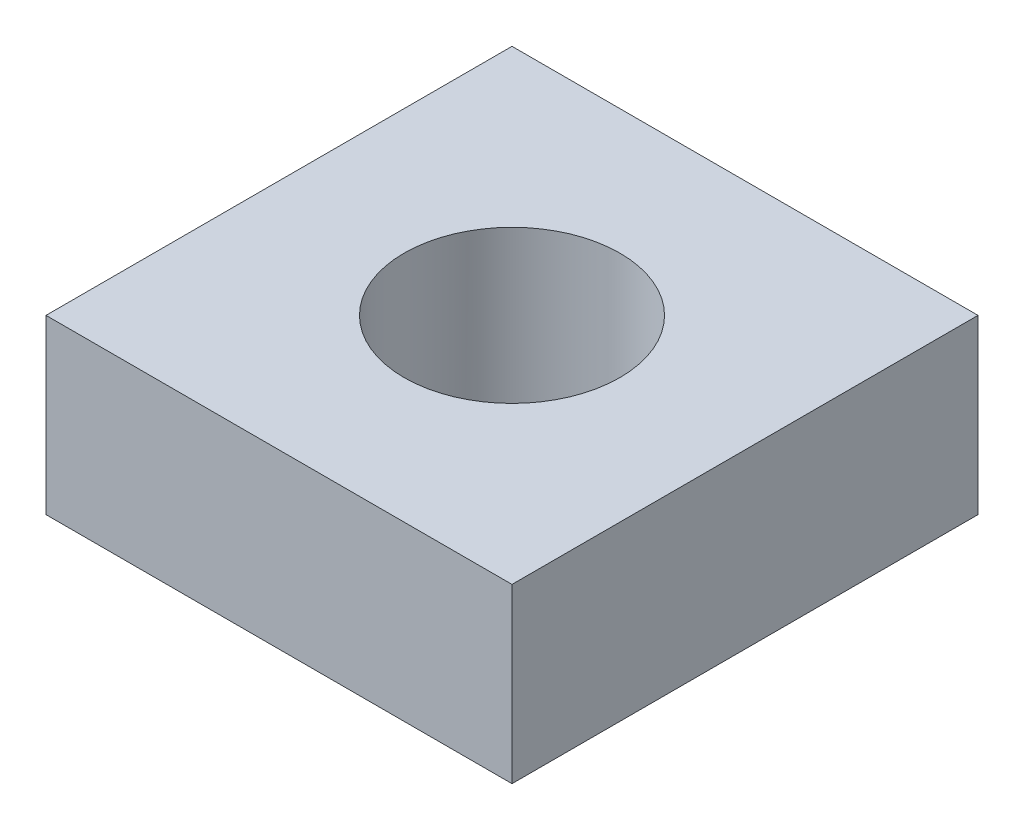
ISO-10303-21;
HEADER;
FILE_DESCRIPTION(('STEP AP214'),'2;1');
FILE_NAME('part.step','',(''),(''),'','','');
FILE_SCHEMA(('AUTOMOTIVE_DESIGN { 1 0 10303 214 1 1 1 1 }'));
ENDSEC;
DATA;
#1=APPLICATION_CONTEXT('core data for automotive mechanical design processes');
#2=APPLICATION_PROTOCOL_DEFINITION('international standard','automotive_design',2000,#1);
#3=PRODUCT_CONTEXT('',#1,'mechanical');
#4=PRODUCT('Part','Part','',(#3));
#5=PRODUCT_RELATED_PRODUCT_CATEGORY('part','',(#4));
#6=PRODUCT_DEFINITION_FORMATION('','',#4);
#7=PRODUCT_DEFINITION_CONTEXT('part definition',#1,'design');
#8=PRODUCT_DEFINITION('design','',#6,#7);
#9=PRODUCT_DEFINITION_SHAPE('','',#8);
#10=(LENGTH_UNIT() NAMED_UNIT(*) SI_UNIT(.MILLI.,.METRE.));
#11=(NAMED_UNIT(*) PLANE_ANGLE_UNIT() SI_UNIT($,.RADIAN.));
#12=(NAMED_UNIT(*) SI_UNIT($,.STERADIAN.) SOLID_ANGLE_UNIT());
#13=UNCERTAINTY_MEASURE_WITH_UNIT(LENGTH_MEASURE(1.E-05),#10,'distance_accuracy_value','');
#14=(GEOMETRIC_REPRESENTATION_CONTEXT(3) GLOBAL_UNCERTAINTY_ASSIGNED_CONTEXT((#13)) GLOBAL_UNIT_ASSIGNED_CONTEXT((#10,
#11,#12)) REPRESENTATION_CONTEXT('',''));
#15=CARTESIAN_POINT('',(0.,0.,0.));
#16=DIRECTION('',(0.,0.,1.));
#17=DIRECTION('',(1.,0.,0.));
#18=AXIS2_PLACEMENT_3D('',#15,#16,#17);
#19=CARTESIAN_POINT('',(2.7,2.,-2.7));
#20=DIRECTION('',(-1.,0.,0.));
#21=DIRECTION('',(0.,0.,1.));
#22=AXIS2_PLACEMENT_3D('',#19,#20,#21);
#23=PLANE('',#22);
#24=DIRECTION('',(0.,0.,-1.));
#25=VECTOR('',#24,1.);
#26=CARTESIAN_POINT('',(2.7,0.,-2.7));
#27=LINE('',#26,#25);
#28=CARTESIAN_POINT('',(2.7,0.,2.7));
#29=VERTEX_POINT('',#28);
#30=CARTESIAN_POINT('',(2.7,0.,-2.7));
#31=VERTEX_POINT('',#30);
#32=EDGE_CURVE('E102',#29,#31,#27,.T.);
#33=ORIENTED_EDGE('',*,*,#32,.T.);
#34=DIRECTION('',(0.,-1.,0.));
#35=VECTOR('',#34,1.);
#36=CARTESIAN_POINT('',(2.7,2.,-2.7));
#37=LINE('',#36,#35);
#38=CARTESIAN_POINT('',(2.7,2.,-2.7));
#39=VERTEX_POINT('',#38);
#40=EDGE_CURVE('E11',#39,#31,#37,.T.);
#41=ORIENTED_EDGE('',*,*,#40,.F.);
#42=DIRECTION('',(0.,0.,-1.));
#43=VECTOR('',#42,1.);
#44=CARTESIAN_POINT('',(2.7,2.,-2.7));
#45=LINE('',#44,#43);
#46=CARTESIAN_POINT('',(2.7,2.,2.7));
#47=VERTEX_POINT('',#46);
#48=EDGE_CURVE('E90',#47,#39,#45,.T.);
#49=ORIENTED_EDGE('',*,*,#48,.F.);
#50=DIRECTION('',(0.,-1.,0.));
#51=VECTOR('',#50,1.);
#52=CARTESIAN_POINT('',(2.7,2.,2.7));
#53=LINE('',#52,#51);
#54=EDGE_CURVE('E98',#47,#29,#53,.T.);
#55=ORIENTED_EDGE('',*,*,#54,.T.);
#56=EDGE_LOOP('',(#33,#41,#49,#55));
#57=FACE_BOUND('',#56,.T.);
#58=ADVANCED_FACE('F39',(#57),#23,.F.);
#59=CARTESIAN_POINT('',(-2.7,2.,-2.7));
#60=DIRECTION('',(0.,0.,1.));
#61=DIRECTION('',(1.,0.,0.));
#62=AXIS2_PLACEMENT_3D('',#59,#60,#61);
#63=PLANE('',#62);
#64=DIRECTION('',(-1.,0.,0.));
#65=VECTOR('',#64,1.);
#66=CARTESIAN_POINT('',(-2.7,0.,-2.7));
#67=LINE('',#66,#65);
#68=CARTESIAN_POINT('',(-2.7,0.,-2.7));
#69=VERTEX_POINT('',#68);
#70=EDGE_CURVE('E94',#31,#69,#67,.T.);
#71=ORIENTED_EDGE('',*,*,#70,.T.);
#72=DIRECTION('',(0.,-1.,0.));
#73=VECTOR('',#72,1.);
#74=CARTESIAN_POINT('',(-2.7,2.,-2.7));
#75=LINE('',#74,#73);
#76=CARTESIAN_POINT('',(-2.7,2.,-2.7));
#77=VERTEX_POINT('',#76);
#78=EDGE_CURVE('E47',#77,#69,#75,.T.);
#79=ORIENTED_EDGE('',*,*,#78,.F.);
#80=DIRECTION('',(-1.,0.,0.));
#81=VECTOR('',#80,1.);
#82=CARTESIAN_POINT('',(-2.7,2.,-2.7));
#83=LINE('',#82,#81);
#84=EDGE_CURVE('E85',#39,#77,#83,.T.);
#85=ORIENTED_EDGE('',*,*,#84,.F.);
#86=ORIENTED_EDGE('',*,*,#40,.T.);
#87=EDGE_LOOP('',(#71,#79,#85,#86));
#88=FACE_BOUND('',#87,.T.);
#89=ADVANCED_FACE('F93',(#88),#63,.F.);
#90=CARTESIAN_POINT('',(-2.7,2.,-2.7));
#91=DIRECTION('',(1.,0.,0.));
#92=DIRECTION('',(0.,0.,-1.));
#93=AXIS2_PLACEMENT_3D('',#90,#91,#92);
#94=PLANE('',#93);
#95=DIRECTION('',(0.,0.,1.));
#96=VECTOR('',#95,1.);
#97=CARTESIAN_POINT('',(-2.7,0.,-2.7));
#98=LINE('',#97,#96);
#99=CARTESIAN_POINT('',(-2.7,0.,2.7));
#100=VERTEX_POINT('',#99);
#101=EDGE_CURVE('E72',#69,#100,#98,.T.);
#102=ORIENTED_EDGE('',*,*,#101,.T.);
#103=DIRECTION('',(0.,-1.,0.));
#104=VECTOR('',#103,1.);
#105=CARTESIAN_POINT('',(-2.7,2.,2.7));
#106=LINE('',#105,#104);
#107=CARTESIAN_POINT('',(-2.7,2.,2.7));
#108=VERTEX_POINT('',#107);
#109=EDGE_CURVE('E95',#108,#100,#106,.T.);
#110=ORIENTED_EDGE('',*,*,#109,.F.);
#111=DIRECTION('',(0.,0.,1.));
#112=VECTOR('',#111,1.);
#113=CARTESIAN_POINT('',(-2.7,2.,-2.7));
#114=LINE('',#113,#112);
#115=EDGE_CURVE('E88',#77,#108,#114,.T.);
#116=ORIENTED_EDGE('',*,*,#115,.F.);
#117=ORIENTED_EDGE('',*,*,#78,.T.);
#118=EDGE_LOOP('',(#102,#110,#116,#117));
#119=FACE_BOUND('',#118,.T.);
#120=ADVANCED_FACE('F96',(#119),#94,.F.);
#121=CARTESIAN_POINT('',(-2.7,2.,2.7));
#122=DIRECTION('',(0.,0.,-1.));
#123=DIRECTION('',(-1.,0.,0.));
#124=AXIS2_PLACEMENT_3D('',#121,#122,#123);
#125=PLANE('',#124);
#126=DIRECTION('',(1.,0.,0.));
#127=VECTOR('',#126,1.);
#128=CARTESIAN_POINT('',(-2.7,0.,2.7));
#129=LINE('',#128,#127);
#130=EDGE_CURVE('E78',#100,#29,#129,.T.);
#131=ORIENTED_EDGE('',*,*,#130,.T.);
#132=ORIENTED_EDGE('',*,*,#54,.F.);
#133=DIRECTION('',(1.,0.,0.));
#134=VECTOR('',#133,1.);
#135=CARTESIAN_POINT('',(-2.7,2.,2.7));
#136=LINE('',#135,#134);
#137=EDGE_CURVE('E55',#108,#47,#136,.T.);
#138=ORIENTED_EDGE('',*,*,#137,.F.);
#139=ORIENTED_EDGE('',*,*,#109,.T.);
#140=EDGE_LOOP('',(#131,#132,#138,#139));
#141=FACE_BOUND('',#140,.T.);
#142=ADVANCED_FACE('F110',(#141),#125,.F.);
#143=CARTESIAN_POINT('',(0.,2.,0.));
#144=DIRECTION('',(0.,1.,0.));
#145=DIRECTION('',(0.,0.,1.));
#146=AXIS2_PLACEMENT_3D('',#143,#144,#145);
#147=PLANE('',#146);
#148=CARTESIAN_POINT('',(0.,2.,0.));
#149=DIRECTION('',(0.,1.,0.));
#150=DIRECTION('',(0.,0.,1.));
#151=AXIS2_PLACEMENT_3D('',#148,#149,#150);
#152=CIRCLE('',#151,1.24999999999999);
#153=CARTESIAN_POINT('',(0.,2.,1.24999999999999));
#154=VERTEX_POINT('',#153);
#155=EDGE_CURVE('E105',#154,#154,#152,.T.);
#156=ORIENTED_EDGE('',*,*,#155,.F.);
#157=EDGE_LOOP('',(#156));
#158=FACE_BOUND('',#157,.T.);
#159=ORIENTED_EDGE('',*,*,#48,.T.);
#160=ORIENTED_EDGE('',*,*,#84,.T.);
#161=ORIENTED_EDGE('',*,*,#115,.T.);
#162=ORIENTED_EDGE('',*,*,#137,.T.);
#163=EDGE_LOOP('',(#159,#160,#161,#162));
#164=FACE_BOUND('',#163,.T.);
#165=ADVANCED_FACE('F86',(#158,#164),#147,.T.);
#166=CARTESIAN_POINT('',(0.,0.,0.));
#167=DIRECTION('',(0.,1.,0.));
#168=DIRECTION('',(0.,0.,1.));
#169=AXIS2_PLACEMENT_3D('',#166,#167,#168);
#170=PLANE('',#169);
#171=CARTESIAN_POINT('',(0.,0.,0.));
#172=DIRECTION('',(0.,-1.,0.));
#173=DIRECTION('',(0.,0.,-1.));
#174=AXIS2_PLACEMENT_3D('',#171,#172,#173);
#175=CIRCLE('',#174,1.24999999999999);
#176=CARTESIAN_POINT('',(0.,0.,-1.24999999999999));
#177=VERTEX_POINT('',#176);
#178=EDGE_CURVE('E118',#177,#177,#175,.T.);
#179=ORIENTED_EDGE('',*,*,#178,.F.);
#180=EDGE_LOOP('',(#179));
#181=FACE_BOUND('',#180,.T.);
#182=ORIENTED_EDGE('',*,*,#32,.F.);
#183=ORIENTED_EDGE('',*,*,#130,.F.);
#184=ORIENTED_EDGE('',*,*,#101,.F.);
#185=ORIENTED_EDGE('',*,*,#70,.F.);
#186=EDGE_LOOP('',(#182,#183,#184,#185));
#187=FACE_BOUND('',#186,.T.);
#188=ADVANCED_FACE('F113',(#181,#187),#170,.F.);
#189=CARTESIAN_POINT('',(0.,0.,0.));
#190=DIRECTION('',(0.,-1.,0.));
#191=DIRECTION('',(0.,0.,-1.));
#192=AXIS2_PLACEMENT_3D('',#189,#190,#191);
#193=CYLINDRICAL_SURFACE('',#192,1.24999999999999);
#194=ORIENTED_EDGE('',*,*,#155,.T.);
#195=EDGE_LOOP('',(#194));
#196=FACE_BOUND('',#195,.T.);
#197=ORIENTED_EDGE('',*,*,#178,.T.);
#198=EDGE_LOOP('',(#197));
#199=FACE_BOUND('',#198,.T.);
#200=ADVANCED_FACE('F122',(#196,#199),#193,.F.);
#201=CLOSED_SHELL('',(#58,#89,#120,#142,#165,#188,#200));
#202=MANIFOLD_SOLID_BREP('B2',#201);
#203=ADVANCED_BREP_SHAPE_REPRESENTATION('',(#18,#202),#14);
#204=SHAPE_DEFINITION_REPRESENTATION(#9,#203);
ENDSEC;
END-ISO-10303-21;
